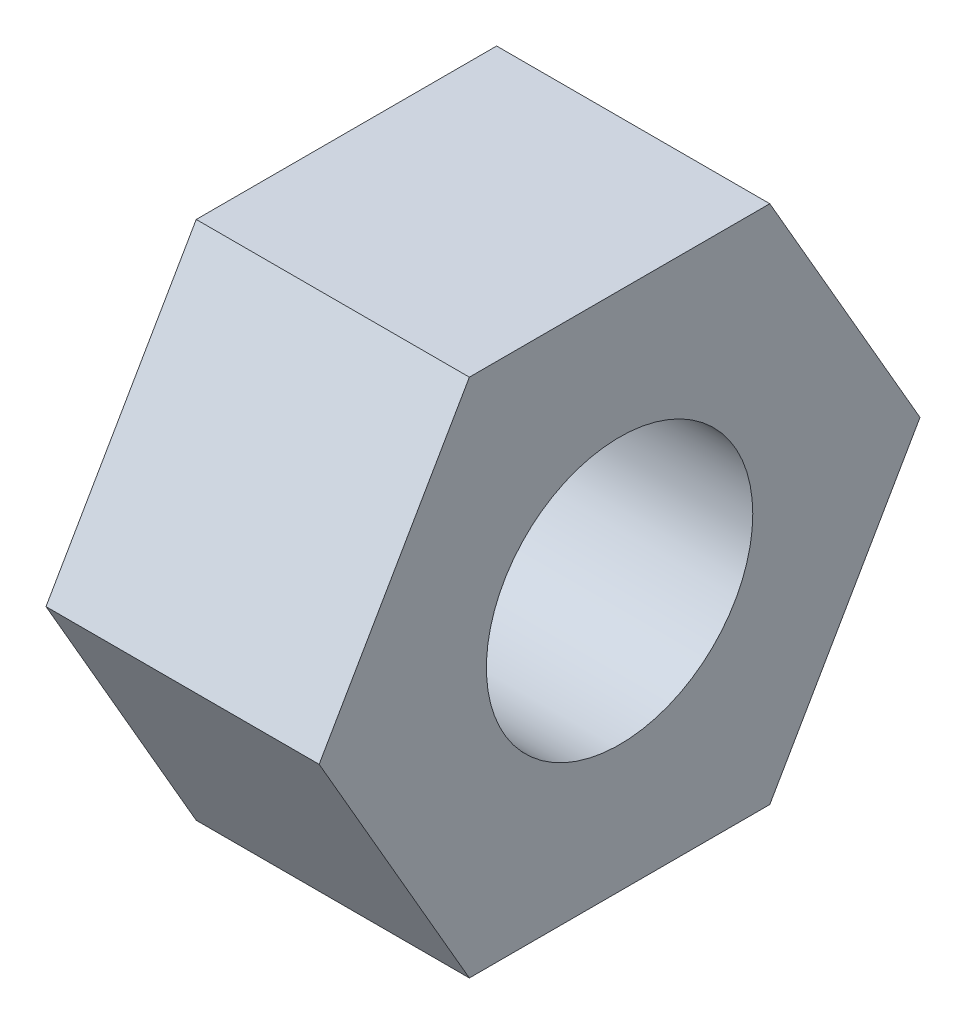
ISO-10303-21;
HEADER;
FILE_DESCRIPTION(('STEP AP214'),'2;1');
FILE_NAME('part.step','',(''),(''),'','','');
FILE_SCHEMA(('AUTOMOTIVE_DESIGN { 1 0 10303 214 1 1 1 1 }'));
ENDSEC;
DATA;
#1=APPLICATION_CONTEXT('core data for automotive mechanical design processes');
#2=APPLICATION_PROTOCOL_DEFINITION('international standard','automotive_design',2000,#1);
#3=PRODUCT_CONTEXT('',#1,'mechanical');
#4=PRODUCT('Part','Part','',(#3));
#5=PRODUCT_RELATED_PRODUCT_CATEGORY('part','',(#4));
#6=PRODUCT_DEFINITION_FORMATION('','',#4);
#7=PRODUCT_DEFINITION_CONTEXT('part definition',#1,'design');
#8=PRODUCT_DEFINITION('design','',#6,#7);
#9=PRODUCT_DEFINITION_SHAPE('','',#8);
#10=(LENGTH_UNIT() NAMED_UNIT(*) SI_UNIT(.MILLI.,.METRE.));
#11=(NAMED_UNIT(*) PLANE_ANGLE_UNIT() SI_UNIT($,.RADIAN.));
#12=(NAMED_UNIT(*) SI_UNIT($,.STERADIAN.) SOLID_ANGLE_UNIT());
#13=UNCERTAINTY_MEASURE_WITH_UNIT(LENGTH_MEASURE(1.E-05),#10,'distance_accuracy_value','');
#14=(GEOMETRIC_REPRESENTATION_CONTEXT(3) GLOBAL_UNCERTAINTY_ASSIGNED_CONTEXT((#13)) GLOBAL_UNIT_ASSIGNED_CONTEXT((#10,
#11,#12)) REPRESENTATION_CONTEXT('',''));
#15=CARTESIAN_POINT('',(0.,0.,0.));
#16=DIRECTION('',(0.,0.,1.));
#17=DIRECTION('',(1.,0.,0.));
#18=AXIS2_PLACEMENT_3D('',#15,#16,#17);
#19=CARTESIAN_POINT('',(2.5,-2.38125,-1.3748153285078));
#20=DIRECTION('',(0.,0.5,0.866025403784439));
#21=DIRECTION('',(0.,-0.866025403784439,0.5));
#22=AXIS2_PLACEMENT_3D('',#19,#20,#21);
#23=PLANE('',#22);
#24=DIRECTION('',(0.,0.866025403784439,-0.5));
#25=VECTOR('',#24,1.);
#26=CARTESIAN_POINT('',(0.,-2.38125,-1.3748153285078));
#27=LINE('',#26,#25);
#28=CARTESIAN_POINT('',(0.,-2.38125,-1.3748153285078));
#29=VERTEX_POINT('',#28);
#30=CARTESIAN_POINT('',(0.,0.,-2.74963065701559));
#31=VERTEX_POINT('',#30);
#32=EDGE_CURVE('E122',#29,#31,#27,.T.);
#33=ORIENTED_EDGE('',*,*,#32,.T.);
#34=DIRECTION('',(-1.,0.,0.));
#35=VECTOR('',#34,1.);
#36=CARTESIAN_POINT('',(2.5,0.,-2.74963065701559));
#37=LINE('',#36,#35);
#38=CARTESIAN_POINT('',(2.5,0.,-2.74963065701559));
#39=VERTEX_POINT('',#38);
#40=EDGE_CURVE('E11',#39,#31,#37,.T.);
#41=ORIENTED_EDGE('',*,*,#40,.F.);
#42=DIRECTION('',(0.,0.866025403784439,-0.5));
#43=VECTOR('',#42,1.);
#44=CARTESIAN_POINT('',(2.5,-2.38125,-1.3748153285078));
#45=LINE('',#44,#43);
#46=CARTESIAN_POINT('',(2.5,-2.38125,-1.3748153285078));
#47=VERTEX_POINT('',#46);
#48=EDGE_CURVE('E133',#47,#39,#45,.T.);
#49=ORIENTED_EDGE('',*,*,#48,.F.);
#50=DIRECTION('',(-1.,0.,0.));
#51=VECTOR('',#50,1.);
#52=CARTESIAN_POINT('',(2.5,-2.38125,-1.3748153285078));
#53=LINE('',#52,#51);
#54=EDGE_CURVE('E118',#47,#29,#53,.T.);
#55=ORIENTED_EDGE('',*,*,#54,.T.);
#56=EDGE_LOOP('',(#33,#41,#49,#55));
#57=FACE_BOUND('',#56,.T.);
#58=ADVANCED_FACE('F38',(#57),#23,.F.);
#59=CARTESIAN_POINT('',(2.5,0.,-2.74963065701559));
#60=DIRECTION('',(0.,-0.5,0.866025403784439));
#61=DIRECTION('',(0.,-0.866025403784439,-0.5));
#62=AXIS2_PLACEMENT_3D('',#59,#60,#61);
#63=PLANE('',#62);
#64=DIRECTION('',(0.,0.866025403784439,0.5));
#65=VECTOR('',#64,1.);
#66=CARTESIAN_POINT('',(0.,0.,-2.74963065701559));
#67=LINE('',#66,#65);
#68=CARTESIAN_POINT('',(0.,2.38125,-1.3748153285078));
#69=VERTEX_POINT('',#68);
#70=EDGE_CURVE('E125',#31,#69,#67,.T.);
#71=ORIENTED_EDGE('',*,*,#70,.T.);
#72=DIRECTION('',(-1.,0.,0.));
#73=VECTOR('',#72,1.);
#74=CARTESIAN_POINT('',(2.5,2.38125,-1.3748153285078));
#75=LINE('',#74,#73);
#76=CARTESIAN_POINT('',(2.5,2.38125,-1.3748153285078));
#77=VERTEX_POINT('',#76);
#78=EDGE_CURVE('E46',#77,#69,#75,.T.);
#79=ORIENTED_EDGE('',*,*,#78,.F.);
#80=DIRECTION('',(0.,0.866025403784439,0.5));
#81=VECTOR('',#80,1.);
#82=CARTESIAN_POINT('',(2.5,0.,-2.74963065701559));
#83=LINE('',#82,#81);
#84=EDGE_CURVE('E91',#39,#77,#83,.T.);
#85=ORIENTED_EDGE('',*,*,#84,.F.);
#86=ORIENTED_EDGE('',*,*,#40,.T.);
#87=EDGE_LOOP('',(#71,#79,#85,#86));
#88=FACE_BOUND('',#87,.T.);
#89=ADVANCED_FACE('F158',(#88),#63,.F.);
#90=CARTESIAN_POINT('',(2.5,2.38125,-1.3748153285078));
#91=DIRECTION('',(0.,-1.,0.));
#92=DIRECTION('',(0.,0.,-1.));
#93=AXIS2_PLACEMENT_3D('',#90,#91,#92);
#94=PLANE('',#93);
#95=DIRECTION('',(0.,0.,1.));
#96=VECTOR('',#95,1.);
#97=CARTESIAN_POINT('',(0.,2.38125,-1.3748153285078));
#98=LINE('',#97,#96);
#99=CARTESIAN_POINT('',(0.,2.38125,1.3748153285078));
#100=VERTEX_POINT('',#99);
#101=EDGE_CURVE('E128',#69,#100,#98,.T.);
#102=ORIENTED_EDGE('',*,*,#101,.T.);
#103=DIRECTION('',(-1.,0.,0.));
#104=VECTOR('',#103,1.);
#105=CARTESIAN_POINT('',(2.5,2.38125,1.3748153285078));
#106=LINE('',#105,#104);
#107=CARTESIAN_POINT('',(2.5,2.38125,1.3748153285078));
#108=VERTEX_POINT('',#107);
#109=EDGE_CURVE('E113',#108,#100,#106,.T.);
#110=ORIENTED_EDGE('',*,*,#109,.F.);
#111=DIRECTION('',(0.,0.,1.));
#112=VECTOR('',#111,1.);
#113=CARTESIAN_POINT('',(2.5,2.38125,-1.3748153285078));
#114=LINE('',#113,#112);
#115=EDGE_CURVE('E104',#77,#108,#114,.T.);
#116=ORIENTED_EDGE('',*,*,#115,.F.);
#117=ORIENTED_EDGE('',*,*,#78,.T.);
#118=EDGE_LOOP('',(#102,#110,#116,#117));
#119=FACE_BOUND('',#118,.T.);
#120=ADVANCED_FACE('F139',(#119),#94,.F.);
#121=CARTESIAN_POINT('',(2.5,2.38125,1.3748153285078));
#122=DIRECTION('',(0.,-0.5,-0.866025403784439));
#123=DIRECTION('',(0.,0.866025403784439,-0.5));
#124=AXIS2_PLACEMENT_3D('',#121,#122,#123);
#125=PLANE('',#124);
#126=DIRECTION('',(0.,-0.866025403784439,0.5));
#127=VECTOR('',#126,1.);
#128=CARTESIAN_POINT('',(0.,2.38125,1.3748153285078));
#129=LINE('',#128,#127);
#130=CARTESIAN_POINT('',(0.,0.,2.74963065701559));
#131=VERTEX_POINT('',#130);
#132=EDGE_CURVE('E112',#100,#131,#129,.T.);
#133=ORIENTED_EDGE('',*,*,#132,.T.);
#134=DIRECTION('',(-1.,0.,0.));
#135=VECTOR('',#134,1.);
#136=CARTESIAN_POINT('',(2.5,0.,2.74963065701559));
#137=LINE('',#136,#135);
#138=CARTESIAN_POINT('',(2.5,0.,2.74963065701559));
#139=VERTEX_POINT('',#138);
#140=EDGE_CURVE('E109',#139,#131,#137,.T.);
#141=ORIENTED_EDGE('',*,*,#140,.F.);
#142=DIRECTION('',(0.,-0.866025403784439,0.5));
#143=VECTOR('',#142,1.);
#144=CARTESIAN_POINT('',(2.5,2.38125,1.3748153285078));
#145=LINE('',#144,#143);
#146=EDGE_CURVE('E98',#108,#139,#145,.T.);
#147=ORIENTED_EDGE('',*,*,#146,.F.);
#148=ORIENTED_EDGE('',*,*,#109,.T.);
#149=EDGE_LOOP('',(#133,#141,#147,#148));
#150=FACE_BOUND('',#149,.T.);
#151=ADVANCED_FACE('F110',(#150),#125,.F.);
#152=CARTESIAN_POINT('',(2.5,0.,2.74963065701559));
#153=DIRECTION('',(0.,0.5,-0.866025403784439));
#154=DIRECTION('',(0.,0.866025403784439,0.5));
#155=AXIS2_PLACEMENT_3D('',#152,#153,#154);
#156=PLANE('',#155);
#157=DIRECTION('',(0.,-0.866025403784439,-0.5));
#158=VECTOR('',#157,1.);
#159=CARTESIAN_POINT('',(0.,0.,2.74963065701559));
#160=LINE('',#159,#158);
#161=CARTESIAN_POINT('',(0.,-2.38125,1.3748153285078));
#162=VERTEX_POINT('',#161);
#163=EDGE_CURVE('E77',#131,#162,#160,.T.);
#164=ORIENTED_EDGE('',*,*,#163,.T.);
#165=DIRECTION('',(-1.,0.,0.));
#166=VECTOR('',#165,1.);
#167=CARTESIAN_POINT('',(2.5,-2.38125,1.3748153285078));
#168=LINE('',#167,#166);
#169=CARTESIAN_POINT('',(2.5,-2.38125,1.3748153285078));
#170=VERTEX_POINT('',#169);
#171=EDGE_CURVE('E114',#170,#162,#168,.T.);
#172=ORIENTED_EDGE('',*,*,#171,.F.);
#173=DIRECTION('',(0.,-0.866025403784439,-0.5));
#174=VECTOR('',#173,1.);
#175=CARTESIAN_POINT('',(2.5,0.,2.74963065701559));
#176=LINE('',#175,#174);
#177=EDGE_CURVE('E102',#139,#170,#176,.T.);
#178=ORIENTED_EDGE('',*,*,#177,.F.);
#179=ORIENTED_EDGE('',*,*,#140,.T.);
#180=EDGE_LOOP('',(#164,#172,#178,#179));
#181=FACE_BOUND('',#180,.T.);
#182=ADVANCED_FACE('F116',(#181),#156,.F.);
#183=CARTESIAN_POINT('',(2.5,-2.38125,1.3748153285078));
#184=DIRECTION('',(0.,1.,0.));
#185=DIRECTION('',(0.,0.,1.));
#186=AXIS2_PLACEMENT_3D('',#183,#184,#185);
#187=PLANE('',#186);
#188=DIRECTION('',(0.,0.,-1.));
#189=VECTOR('',#188,1.);
#190=CARTESIAN_POINT('',(0.,-2.38125,1.3748153285078));
#191=LINE('',#190,#189);
#192=EDGE_CURVE('E83',#162,#29,#191,.T.);
#193=ORIENTED_EDGE('',*,*,#192,.T.);
#194=ORIENTED_EDGE('',*,*,#54,.F.);
#195=DIRECTION('',(0.,0.,-1.));
#196=VECTOR('',#195,1.);
#197=CARTESIAN_POINT('',(2.5,-2.38125,1.3748153285078));
#198=LINE('',#197,#196);
#199=EDGE_CURVE('E54',#170,#47,#198,.T.);
#200=ORIENTED_EDGE('',*,*,#199,.F.);
#201=ORIENTED_EDGE('',*,*,#171,.T.);
#202=EDGE_LOOP('',(#193,#194,#200,#201));
#203=FACE_BOUND('',#202,.T.);
#204=ADVANCED_FACE('F146',(#203),#187,.F.);
#205=CARTESIAN_POINT('',(2.5,0.,0.));
#206=DIRECTION('',(1.,0.,0.));
#207=DIRECTION('',(0.,0.,-1.));
#208=AXIS2_PLACEMENT_3D('',#205,#206,#207);
#209=PLANE('',#208);
#210=CARTESIAN_POINT('',(2.5,0.,0.));
#211=DIRECTION('',(1.,0.,0.));
#212=DIRECTION('',(0.,0.,-1.));
#213=AXIS2_PLACEMENT_3D('',#210,#211,#212);
#214=CIRCLE('',#213,1.21919999999999);
#215=CARTESIAN_POINT('',(2.5,0.,-1.21919999999999));
#216=VERTEX_POINT('',#215);
#217=EDGE_CURVE('E213',#216,#216,#214,.T.);
#218=ORIENTED_EDGE('',*,*,#217,.F.);
#219=EDGE_LOOP('',(#218));
#220=FACE_BOUND('',#219,.T.);
#221=ORIENTED_EDGE('',*,*,#48,.T.);
#222=ORIENTED_EDGE('',*,*,#84,.T.);
#223=ORIENTED_EDGE('',*,*,#115,.T.);
#224=ORIENTED_EDGE('',*,*,#146,.T.);
#225=ORIENTED_EDGE('',*,*,#177,.T.);
#226=ORIENTED_EDGE('',*,*,#199,.T.);
#227=EDGE_LOOP('',(#221,#222,#223,#224,#225,#226));
#228=FACE_BOUND('',#227,.T.);
#229=ADVANCED_FACE('F100',(#220,#228),#209,.T.);
#230=CARTESIAN_POINT('',(0.,0.,0.));
#231=DIRECTION('',(1.,0.,0.));
#232=DIRECTION('',(0.,0.,-1.));
#233=AXIS2_PLACEMENT_3D('',#230,#231,#232);
#234=PLANE('',#233);
#235=CARTESIAN_POINT('',(0.,0.,0.));
#236=DIRECTION('',(1.,0.,0.));
#237=DIRECTION('',(0.,0.,-1.));
#238=AXIS2_PLACEMENT_3D('',#235,#236,#237);
#239=CIRCLE('',#238,1.2192);
#240=CARTESIAN_POINT('',(0.,0.,-1.2192));
#241=VERTEX_POINT('',#240);
#242=EDGE_CURVE('E126',#241,#241,#239,.T.);
#243=ORIENTED_EDGE('',*,*,#242,.T.);
#244=EDGE_LOOP('',(#243));
#245=FACE_BOUND('',#244,.T.);
#246=ORIENTED_EDGE('',*,*,#32,.F.);
#247=ORIENTED_EDGE('',*,*,#192,.F.);
#248=ORIENTED_EDGE('',*,*,#163,.F.);
#249=ORIENTED_EDGE('',*,*,#132,.F.);
#250=ORIENTED_EDGE('',*,*,#101,.F.);
#251=ORIENTED_EDGE('',*,*,#70,.F.);
#252=EDGE_LOOP('',(#246,#247,#248,#249,#250,#251));
#253=FACE_BOUND('',#252,.T.);
#254=ADVANCED_FACE('F142',(#245,#253),#234,.F.);
#255=CARTESIAN_POINT('',(2.5,0.,0.));
#256=DIRECTION('',(1.,0.,0.));
#257=DIRECTION('',(0.,0.,-1.));
#258=AXIS2_PLACEMENT_3D('',#255,#256,#257);
#259=CYLINDRICAL_SURFACE('',#258,1.21919999999999);
#260=ORIENTED_EDGE('',*,*,#242,.F.);
#261=EDGE_LOOP('',(#260));
#262=FACE_BOUND('',#261,.T.);
#263=ORIENTED_EDGE('',*,*,#217,.T.);
#264=EDGE_LOOP('',(#263));
#265=FACE_BOUND('',#264,.T.);
#266=ADVANCED_FACE('F195',(#262,#265),#259,.F.);
#267=CLOSED_SHELL('',(#58,#89,#120,#151,#182,#204,#229,#254,#266));
#268=MANIFOLD_SOLID_BREP('B2',#267);
#269=ADVANCED_BREP_SHAPE_REPRESENTATION('',(#18,#268),#14);
#270=SHAPE_DEFINITION_REPRESENTATION(#9,#269);
ENDSEC;
END-ISO-10303-21;
